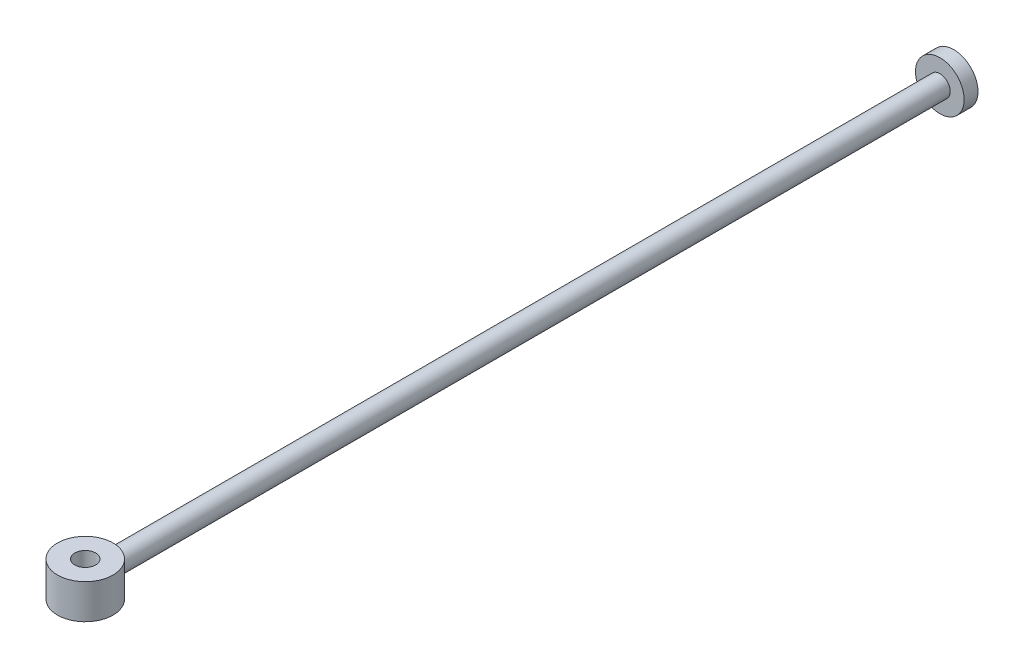
ISO-10303-21;
HEADER;
FILE_DESCRIPTION(('STEP AP214'),'2;1');
FILE_NAME('part.step','',(''),(''),'','','');
FILE_SCHEMA(('AUTOMOTIVE_DESIGN { 1 0 10303 214 1 1 1 1 }'));
ENDSEC;
DATA;
#1=APPLICATION_CONTEXT('core data for automotive mechanical design processes');
#2=APPLICATION_PROTOCOL_DEFINITION('international standard','automotive_design',2000,#1);
#3=PRODUCT_CONTEXT('',#1,'mechanical');
#4=PRODUCT('Part','Part','',(#3));
#5=PRODUCT_RELATED_PRODUCT_CATEGORY('part','',(#4));
#6=PRODUCT_DEFINITION_FORMATION('','',#4);
#7=PRODUCT_DEFINITION_CONTEXT('part definition',#1,'design');
#8=PRODUCT_DEFINITION('design','',#6,#7);
#9=PRODUCT_DEFINITION_SHAPE('','',#8);
#10=(LENGTH_UNIT() NAMED_UNIT(*) SI_UNIT(.MILLI.,.METRE.));
#11=(NAMED_UNIT(*) PLANE_ANGLE_UNIT() SI_UNIT($,.RADIAN.));
#12=(NAMED_UNIT(*) SI_UNIT($,.STERADIAN.) SOLID_ANGLE_UNIT());
#13=UNCERTAINTY_MEASURE_WITH_UNIT(LENGTH_MEASURE(1.E-05),#10,'distance_accuracy_value','');
#14=(GEOMETRIC_REPRESENTATION_CONTEXT(3) GLOBAL_UNCERTAINTY_ASSIGNED_CONTEXT((#13)) GLOBAL_UNIT_ASSIGNED_CONTEXT((#10,
#11,#12)) REPRESENTATION_CONTEXT('',''));
#15=CARTESIAN_POINT('',(0.,0.,0.));
#16=DIRECTION('',(0.,0.,1.));
#17=DIRECTION('',(1.,0.,0.));
#18=AXIS2_PLACEMENT_3D('',#15,#16,#17);
#19=CARTESIAN_POINT('',(0.,-2.5,125.));
#20=DIRECTION('',(0.,1.,0.));
#21=DIRECTION('',(0.,0.,1.));
#22=AXIS2_PLACEMENT_3D('',#19,#20,#21);
#23=CYLINDRICAL_SURFACE('',#22,4.);
#24=CARTESIAN_POINT('',(0.,-2.5,125.));
#25=DIRECTION('',(0.,1.,0.));
#26=DIRECTION('',(0.,0.,1.));
#27=AXIS2_PLACEMENT_3D('',#24,#25,#26);
#28=CIRCLE('',#27,4.);
#29=CARTESIAN_POINT('',(0.,-2.5,129.));
#30=VERTEX_POINT('',#29);
#31=EDGE_CURVE('E11',#30,#30,#28,.T.);
#32=ORIENTED_EDGE('',*,*,#31,.T.);
#33=EDGE_LOOP('',(#32));
#34=FACE_BOUND('',#33,.T.);
#35=CARTESIAN_POINT('',(0.,2.5,125.));
#36=DIRECTION('',(0.,1.,0.));
#37=DIRECTION('',(0.,0.,1.));
#38=AXIS2_PLACEMENT_3D('',#35,#36,#37);
#39=CIRCLE('',#38,4.);
#40=CARTESIAN_POINT('',(0.,2.5,129.));
#41=VERTEX_POINT('',#40);
#42=EDGE_CURVE('E50',#41,#41,#39,.T.);
#43=ORIENTED_EDGE('',*,*,#42,.F.);
#44=EDGE_LOOP('',(#43));
#45=FACE_BOUND('',#44,.T.);
#46=ADVANCED_FACE('F40',(#34,#45),#23,.T.);
#47=CARTESIAN_POINT('',(0.,-2.5,125.));
#48=DIRECTION('',(0.,1.,0.));
#49=DIRECTION('',(0.,0.,1.));
#50=AXIS2_PLACEMENT_3D('',#47,#48,#49);
#51=PLANE('',#50);
#52=CARTESIAN_POINT('',(0.,-2.5,125.));
#53=DIRECTION('',(0.,1.,0.));
#54=DIRECTION('',(0.,0.,1.));
#55=AXIS2_PLACEMENT_3D('',#52,#53,#54);
#56=CIRCLE('',#55,1.5);
#57=CARTESIAN_POINT('',(0.,-2.5,126.5));
#58=VERTEX_POINT('',#57);
#59=EDGE_CURVE('E46',#58,#58,#56,.T.);
#60=ORIENTED_EDGE('',*,*,#59,.T.);
#61=EDGE_LOOP('',(#60));
#62=FACE_BOUND('',#61,.T.);
#63=ORIENTED_EDGE('',*,*,#31,.F.);
#64=EDGE_LOOP('',(#63));
#65=FACE_BOUND('',#64,.T.);
#66=ADVANCED_FACE('F69',(#62,#65),#51,.F.);
#67=CARTESIAN_POINT('',(0.,-2.5,125.));
#68=DIRECTION('',(0.,1.,0.));
#69=DIRECTION('',(0.,0.,1.));
#70=AXIS2_PLACEMENT_3D('',#67,#68,#69);
#71=CYLINDRICAL_SURFACE('',#70,1.5);
#72=ORIENTED_EDGE('',*,*,#59,.F.);
#73=EDGE_LOOP('',(#72));
#74=FACE_BOUND('',#73,.T.);
#75=CARTESIAN_POINT('',(0.,2.5,125.));
#76=DIRECTION('',(0.,1.,0.));
#77=DIRECTION('',(0.,0.,1.));
#78=AXIS2_PLACEMENT_3D('',#75,#76,#77);
#79=CIRCLE('',#78,1.5);
#80=CARTESIAN_POINT('',(0.,2.5,126.5));
#81=VERTEX_POINT('',#80);
#82=EDGE_CURVE('E54',#81,#81,#79,.T.);
#83=ORIENTED_EDGE('',*,*,#82,.T.);
#84=EDGE_LOOP('',(#83));
#85=FACE_BOUND('',#84,.T.);
#86=ADVANCED_FACE('F60',(#74,#85),#71,.F.);
#87=CARTESIAN_POINT('',(0.,2.5,125.));
#88=DIRECTION('',(0.,1.,0.));
#89=DIRECTION('',(0.,0.,1.));
#90=AXIS2_PLACEMENT_3D('',#87,#88,#89);
#91=PLANE('',#90);
#92=ORIENTED_EDGE('',*,*,#42,.T.);
#93=EDGE_LOOP('',(#92));
#94=FACE_BOUND('',#93,.T.);
#95=ORIENTED_EDGE('',*,*,#82,.F.);
#96=EDGE_LOOP('',(#95));
#97=FACE_BOUND('',#96,.T.);
#98=ADVANCED_FACE('F62',(#94,#97),#91,.T.);
#99=CLOSED_SHELL('',(#46,#66,#86,#98));
#100=MANIFOLD_SOLID_BREP('B2',#99);
#101=CARTESIAN_POINT('',(0.,0.,121.));
#102=DIRECTION('',(0.,0.,-1.));
#103=DIRECTION('',(-1.,0.,0.));
#104=AXIS2_PLACEMENT_3D('',#101,#102,#103);
#105=CYLINDRICAL_SURFACE('',#104,1.5);
#106=CARTESIAN_POINT('',(0.,0.,121.));
#107=DIRECTION('',(0.,0.,1.));
#108=DIRECTION('',(1.,0.,0.));
#109=AXIS2_PLACEMENT_3D('',#106,#107,#108);
#110=CIRCLE('',#109,1.5);
#111=CARTESIAN_POINT('',(1.5,0.,121.));
#112=VERTEX_POINT('',#111);
#113=EDGE_CURVE('E107',#112,#112,#110,.T.);
#114=ORIENTED_EDGE('',*,*,#113,.F.);
#115=EDGE_LOOP('',(#114));
#116=FACE_BOUND('',#115,.T.);
#117=CARTESIAN_POINT('',(0.,0.,2.));
#118=DIRECTION('',(0.,0.,-1.));
#119=DIRECTION('',(-1.,0.,0.));
#120=AXIS2_PLACEMENT_3D('',#117,#118,#119);
#121=CIRCLE('',#120,1.5);
#122=CARTESIAN_POINT('',(-1.5,0.,2.));
#123=VERTEX_POINT('',#122);
#124=EDGE_CURVE('E39',#123,#123,#121,.T.);
#125=ORIENTED_EDGE('',*,*,#124,.F.);
#126=EDGE_LOOP('',(#125));
#127=FACE_BOUND('',#126,.T.);
#128=ADVANCED_FACE('F101',(#116,#127),#105,.T.);
#129=CARTESIAN_POINT('',(0.,0.,121.));
#130=DIRECTION('',(0.,0.,1.));
#131=DIRECTION('',(1.,0.,0.));
#132=AXIS2_PLACEMENT_3D('',#129,#130,#131);
#133=PLANE('',#132);
#134=ORIENTED_EDGE('',*,*,#113,.T.);
#135=EDGE_LOOP('',(#134));
#136=FACE_BOUND('',#135,.T.);
#137=ADVANCED_FACE('F126',(#136),#133,.T.);
#138=CARTESIAN_POINT('',(0.,0.,2.));
#139=DIRECTION('',(0.,0.,-1.));
#140=DIRECTION('',(-1.,0.,0.));
#141=AXIS2_PLACEMENT_3D('',#138,#139,#140);
#142=CYLINDRICAL_SURFACE('',#141,3.5);
#143=CARTESIAN_POINT('',(0.,0.,2.));
#144=DIRECTION('',(0.,0.,-1.));
#145=DIRECTION('',(-1.,0.,0.));
#146=AXIS2_PLACEMENT_3D('',#143,#144,#145);
#147=CIRCLE('',#146,3.5);
#148=CARTESIAN_POINT('',(-3.5,0.,2.));
#149=VERTEX_POINT('',#148);
#150=EDGE_CURVE('E111',#149,#149,#147,.T.);
#151=ORIENTED_EDGE('',*,*,#150,.T.);
#152=EDGE_LOOP('',(#151));
#153=FACE_BOUND('',#152,.T.);
#154=CARTESIAN_POINT('',(0.,0.,0.));
#155=DIRECTION('',(0.,0.,-1.));
#156=DIRECTION('',(-1.,0.,0.));
#157=AXIS2_PLACEMENT_3D('',#154,#155,#156);
#158=CIRCLE('',#157,3.5);
#159=CARTESIAN_POINT('',(-3.5,0.,0.));
#160=VERTEX_POINT('',#159);
#161=EDGE_CURVE('E115',#160,#160,#158,.T.);
#162=ORIENTED_EDGE('',*,*,#161,.F.);
#163=EDGE_LOOP('',(#162));
#164=FACE_BOUND('',#163,.T.);
#165=ADVANCED_FACE('F123',(#153,#164),#142,.T.);
#166=CARTESIAN_POINT('',(0.,0.,2.));
#167=DIRECTION('',(0.,0.,-1.));
#168=DIRECTION('',(-1.,0.,0.));
#169=AXIS2_PLACEMENT_3D('',#166,#167,#168);
#170=PLANE('',#169);
#171=ORIENTED_EDGE('',*,*,#124,.T.);
#172=EDGE_LOOP('',(#171));
#173=FACE_BOUND('',#172,.T.);
#174=ORIENTED_EDGE('',*,*,#150,.F.);
#175=EDGE_LOOP('',(#174));
#176=FACE_BOUND('',#175,.T.);
#177=ADVANCED_FACE('F125',(#173,#176),#170,.F.);
#178=CARTESIAN_POINT('',(0.,0.,0.));
#179=DIRECTION('',(0.,0.,1.));
#180=DIRECTION('',(1.,0.,0.));
#181=AXIS2_PLACEMENT_3D('',#178,#179,#180);
#182=PLANE('',#181);
#183=ORIENTED_EDGE('',*,*,#161,.T.);
#184=EDGE_LOOP('',(#183));
#185=FACE_BOUND('',#184,.T.);
#186=ADVANCED_FACE('F121',(#185),#182,.F.);
#187=CLOSED_SHELL('',(#128,#137,#165,#177,#186));
#188=MANIFOLD_SOLID_BREP('B6',#187);
#189=ADVANCED_BREP_SHAPE_REPRESENTATION('',(#18,#100,#188),#14);
#190=SHAPE_DEFINITION_REPRESENTATION(#9,#189);
ENDSEC;
END-ISO-10303-21;
